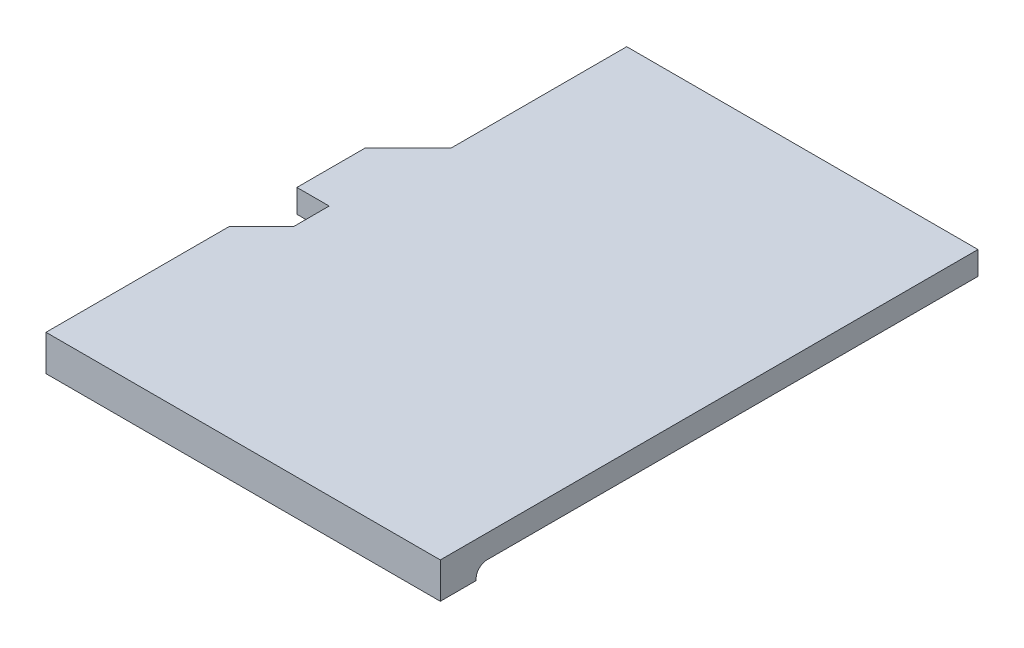
ISO-10303-21;
HEADER;
FILE_DESCRIPTION(('STEP AP214'),'2;1');
FILE_NAME('part.step','',(''),(''),'','','');
FILE_SCHEMA(('AUTOMOTIVE_DESIGN { 1 0 10303 214 1 1 1 1 }'));
ENDSEC;
DATA;
#1=APPLICATION_CONTEXT('core data for automotive mechanical design processes');
#2=APPLICATION_PROTOCOL_DEFINITION('international standard','automotive_design',2000,#1);
#3=PRODUCT_CONTEXT('',#1,'mechanical');
#4=PRODUCT('Part','Part','',(#3));
#5=PRODUCT_RELATED_PRODUCT_CATEGORY('part','',(#4));
#6=PRODUCT_DEFINITION_FORMATION('','',#4);
#7=PRODUCT_DEFINITION_CONTEXT('part definition',#1,'design');
#8=PRODUCT_DEFINITION('design','',#6,#7);
#9=PRODUCT_DEFINITION_SHAPE('','',#8);
#10=(LENGTH_UNIT() NAMED_UNIT(*) SI_UNIT(.MILLI.,.METRE.));
#11=(NAMED_UNIT(*) PLANE_ANGLE_UNIT() SI_UNIT($,.RADIAN.));
#12=(NAMED_UNIT(*) SI_UNIT($,.STERADIAN.) SOLID_ANGLE_UNIT());
#13=UNCERTAINTY_MEASURE_WITH_UNIT(LENGTH_MEASURE(1.E-05),#10,'distance_accuracy_value','');
#14=(GEOMETRIC_REPRESENTATION_CONTEXT(3) GLOBAL_UNCERTAINTY_ASSIGNED_CONTEXT((#13)) GLOBAL_UNIT_ASSIGNED_CONTEXT((#10,
#11,#12)) REPRESENTATION_CONTEXT('',''));
#15=CARTESIAN_POINT('',(0.,0.,0.));
#16=DIRECTION('',(0.,0.,1.));
#17=DIRECTION('',(1.,0.,0.));
#18=AXIS2_PLACEMENT_3D('',#15,#16,#17);
#19=CARTESIAN_POINT('',(0.,0.,36.5));
#20=DIRECTION('',(0.,-1.,0.));
#21=DIRECTION('',(0.,0.,-1.));
#22=AXIS2_PLACEMENT_3D('',#19,#20,#21);
#23=CYLINDRICAL_SURFACE('',#22,30.5);
#24=CARTESIAN_POINT('',(0.,-0.300000000000005,36.4999999999999));
#25=DIRECTION('',(0.,-1.,0.));
#26=DIRECTION('',(0.,0.,-1.));
#27=AXIS2_PLACEMENT_3D('',#24,#25,#26);
#28=CIRCLE('',#27,30.4999999999999);
#29=CARTESIAN_POINT('',(-5.5,-0.299999999999936,6.5000000000003));
#30=VERTEX_POINT('',#29);
#31=CARTESIAN_POINT('',(5.5,-0.3,6.5));
#32=VERTEX_POINT('',#31);
#33=EDGE_CURVE('E129',#30,#32,#28,.T.);
#34=ORIENTED_EDGE('',*,*,#33,.T.);
#35=DIRECTION('',(0.,-1.,0.));
#36=VECTOR('',#35,1.);
#37=CARTESIAN_POINT('',(5.5,0.,6.5));
#38=LINE('',#37,#36);
#39=CARTESIAN_POINT('',(5.5,-0.35,6.5));
#40=VERTEX_POINT('',#39);
#41=EDGE_CURVE('E115',#32,#40,#38,.T.);
#42=ORIENTED_EDGE('',*,*,#41,.T.);
#43=CARTESIAN_POINT('',(0.,-0.35,36.5));
#44=DIRECTION('',(0.,-1.,0.));
#45=DIRECTION('',(0.,0.,-1.));
#46=AXIS2_PLACEMENT_3D('',#43,#44,#45);
#47=CIRCLE('',#46,30.5);
#48=CARTESIAN_POINT('',(-5.5,-0.35,6.5));
#49=VERTEX_POINT('',#48);
#50=EDGE_CURVE('E143',#49,#40,#47,.T.);
#51=ORIENTED_EDGE('',*,*,#50,.F.);
#52=DIRECTION('',(0.,-1.,0.));
#53=VECTOR('',#52,1.);
#54=CARTESIAN_POINT('',(-5.5,0.,6.5));
#55=LINE('',#54,#53);
#56=EDGE_CURVE('E125',#49,#30,#55,.F.);
#57=ORIENTED_EDGE('',*,*,#56,.T.);
#58=EDGE_LOOP('',(#34,#42,#51,#57));
#59=FACE_BOUND('',#58,.T.);
#60=ADVANCED_FACE('F17',(#59),#23,.T.);
#61=CARTESIAN_POINT('',(0.,-0.300000000000007,36.4999999999999));
#62=DIRECTION('',(0.,1.,0.));
#63=DIRECTION('',(0.,0.,1.));
#64=AXIS2_PLACEMENT_3D('',#61,#62,#63);
#65=TOROIDAL_SURFACE('',#64,30.7999999999999,0.300000000000001);
#66=CARTESIAN_POINT('',(-5.5,0.,6.19504990929698));
#67=CARTESIAN_POINT('',(-5.5,1.33595165803878E-05,6.21241243593624));
#68=CARTESIAN_POINT('',(-5.5,-0.00145847501518897,6.22977221696308));
#69=CARTESIAN_POINT('',(-5.5,-0.00727537190632978,6.26399834794666));
#70=CARTESIAN_POINT('',(-5.5,-0.0116195368900843,6.28086485029587));
#71=CARTESIAN_POINT('',(-5.5,-0.0230876833958898,6.31363832371031));
#72=CARTESIAN_POINT('',(-5.5,-0.0302134268310064,6.32954467920917));
#73=CARTESIAN_POINT('',(-5.5,-0.0470507927273738,6.35991909095671));
#74=CARTESIAN_POINT('',(-5.5,-0.0567616224740036,6.37438758625935));
#75=CARTESIAN_POINT('',(-5.5,-0.0784276850797013,6.40135826971645));
#76=CARTESIAN_POINT('',(-5.5,-0.0903658227964889,6.41387418307365));
#77=CARTESIAN_POINT('',(-5.5,-0.116206697824979,6.43668838299136));
#78=CARTESIAN_POINT('',(-5.5,-0.130109746817412,6.4469863170733));
#79=CARTESIAN_POINT('',(-5.5,-0.159253139328433,6.4648982722723));
#80=CARTESIAN_POINT('',(-5.5,-0.17446970156573,6.47255103541422));
#81=CARTESIAN_POINT('',(-5.5,-0.205980553533483,6.48514460028019));
#82=CARTESIAN_POINT('',(-5.5,-0.22227394286474,6.4900876364088));
#83=CARTESIAN_POINT('',(-5.5,-0.248909602666306,6.49572631465982));
#84=CARTESIAN_POINT('',(-5.5,-0.259068672797319,6.4973280220839));
#85=CARTESIAN_POINT('',(-5.5,-0.279483577244796,6.49946458474798));
#86=CARTESIAN_POINT('',(-5.5,-0.289739251433868,6.50000097058269));
#87=CARTESIAN_POINT('',(-5.5,-0.299999999999871,6.50000000000061));
#88=B_SPLINE_CURVE_WITH_KNOTS('',3,(#66,#67,#68,#69,#70,#71,#72,#73,#74,#75,#76,#77,#78,#79,#80,
#81,#82,#83,#84,#85,#86,#87),.UNSPECIFIED.,.F.,.F.,(4,2,2,2,2,2,2,2,2,2,4),(0.,
0.0520216969549496,0.104027148927333,0.156065595891923,0.208088103654182,0.259726629690666,
0.311373356013652,0.362227951009608,0.413040548668621,0.443843163482689,0.474601490708804),.UNSPECIFIED.);
#89=CARTESIAN_POINT('',(-5.49999999999999,0.,6.19504990929698));
#90=VERTEX_POINT('',#89);
#91=EDGE_CURVE('E131',#90,#30,#88,.T.);
#92=ORIENTED_EDGE('',*,*,#91,.F.);
#93=CARTESIAN_POINT('',(-5.49999999999998,0.,6.19504990929698));
#94=CARTESIAN_POINT('',(-5.31863837402074,-2.79888751644408E-10,6.16213458757296));
#95=CARTESIAN_POINT('',(-5.13698177051986,-3.89986718033549E-11,6.13084467826896));
#96=CARTESIAN_POINT('',(-4.77314267713024,-2.63799173422511E-10,6.07152558301701));
#97=CARTESIAN_POINT('',(-4.59096020355433,-7.29468067132481E-10,6.04349629701301));
#98=CARTESIAN_POINT('',(-4.22612778424785,-4.11527474624292E-09,5.99070711898726));
#99=CARTESIAN_POINT('',(-4.04347785274138,-7.03533871261316E-09,5.96594712866323));
#100=CARTESIAN_POINT('',(-3.67776898719352,-1.7491268445544E-08,5.91970526678066));
#101=CARTESIAN_POINT('',(-3.49471006535823,-2.50269982460297E-08,5.898223298683));
#102=CARTESIAN_POINT('',(-3.12824231984767,-5.2489278225927E-08,5.85853971393701));
#103=CARTESIAN_POINT('',(-2.94483350641475,-7.24154710846567E-08,5.84033800271096));
#104=CARTESIAN_POINT('',(-2.57765331341793,-1.16842041325099E-07,5.80723049133915));
#105=CARTESIAN_POINT('',(-2.39388182880072,-1.41344029382589E-07,5.79232585580913));
#106=CARTESIAN_POINT('',(-2.02611648635591,-1.68785372301173E-07,5.7658417103048));
#107=CARTESIAN_POINT('',(-1.84212265072332,-1.71726725960301E-07,5.75426189219593));
#108=CARTESIAN_POINT('',(-1.47397325036579,-1.5812156273675E-07,5.73443005392329));
#109=CARTESIAN_POINT('',(-1.28981770257959,-1.41576888643872E-07,5.72617771917914));
#110=CARTESIAN_POINT('',(-0.92140570267484,-9.59041238819305E-08,5.71298847020463));
#111=CARTESIAN_POINT('',(-0.737149261997189,-6.67772466262512E-08,5.70805123638695));
#112=CARTESIAN_POINT('',(-0.368594128918169,-2.07680761947441E-08,5.70154964542096));
#113=CARTESIAN_POINT('',(-0.184295442448436,-3.88457999455793E-09,5.69998495685937));
#114=CARTESIAN_POINT('',(0.086356471172345,1.82022081381326E-09,5.70000704885872));
#115=CARTESIAN_POINT('',(0.172712230075287,7.86351842313828E-10,5.70036094948924));
#116=CARTESIAN_POINT('',(0.476263755755936,-2.79274083912713E-09,5.7028806791863));
#117=CARTESIAN_POINT('',(0.693448061531879,-5.25435587275127E-09,5.7069794575203));
#118=CARTESIAN_POINT('',(1.06816857762278,-1.97365099193209E-08,5.71801281588737));
#119=CARTESIAN_POINT('',(1.22573814440945,-2.8952196858608E-08,5.72386224765594));
#120=CARTESIAN_POINT('',(1.48630232058884,-4.72230161169837E-08,5.7355408202662));
#121=CARTESIAN_POINT('',(1.58932833528275,-5.52318131245086E-08,5.74067760392298));
#122=CARTESIAN_POINT('',(1.88171570179904,-7.7766223504317E-08,5.75673240973428));
#123=CARTESIAN_POINT('',(2.07101095849516,-9.21235436615534E-08,5.76888568094614));
#124=CARTESIAN_POINT('',(2.42722706640843,-1.10143179472391E-07,5.79507406154739));
#125=CARTESIAN_POINT('',(2.59417658530175,-1.14859561468694E-07,5.80872308812261));
#126=CARTESIAN_POINT('',(2.94460729886679,-1.15857233898678E-07,5.84026240269234));
#127=CARTESIAN_POINT('',(3.12806264619123,-1.11242583252215E-07,5.85844117104809));
#128=CARTESIAN_POINT('',(3.4946095666402,-9.80308122850376E-08,5.89809426472975));
#129=CARTESIAN_POINT('',(3.67770115300804,-8.94338397180247E-08,5.91956846776736));
#130=CARTESIAN_POINT('',(4.04346152617939,-6.89925498860165E-08,5.96580673193215));
#131=CARTESIAN_POINT('',(4.22613032868293,-5.71483552225677E-08,5.99057066883453));
#132=CARTESIAN_POINT('',(4.59098584954234,-3.40389433412459E-08,6.04337962935026));
#133=CARTESIAN_POINT('',(4.77317258614175,-2.27737039070489E-08,6.07142452692736));
#134=CARTESIAN_POINT('',(5.13700500332876,-5.88767180051038E-09,6.13078580710959));
#135=CARTESIAN_POINT('',(5.31865070476836,-2.66658712612276E-10,6.16210206191056));
#136=CARTESIAN_POINT('',(5.5,0.,6.19504990929699));
#137=B_SPLINE_CURVE_WITH_KNOTS('',3,(#93,#94,#95,#96,#97,#98,#99,#100,#101,#102,#103,#104,#105,
#106,#107,#108,#109,#110,#111,#112,#113,#114,#115,#116,#117,#118,#119,#120,#121,#122,#123,#124,
#125,#126,#127,#128,#129,#130,#131,#132,#133,#134,#135,#136),.UNSPECIFIED.,.F.,.F.,(4,2,2,2,2,2,
2,2,2,2,2,2,2,2,2,2,2,2,2,2,2,4),(0.,0.552965554943508,1.10591413701329,1.65884608905149,
2.21176175386818,2.7646614742412,3.31775618290503,3.87079961577708,4.42379075163999,
4.97672856956743,5.52961204892394,5.78868012794092,6.44029213807924,6.91330877259719,
7.22276653290295,7.79178519840863,8.29428388730775,8.84731463363147,9.40032486283035,
9.95331421554694,10.5062823324631,11.0592288542998),.UNSPECIFIED.);
#138=CARTESIAN_POINT('',(5.5,0.,6.19504990929699));
#139=VERTEX_POINT('',#138);
#140=EDGE_CURVE('E134',#90,#139,#137,.T.);
#141=ORIENTED_EDGE('',*,*,#140,.T.);
#142=CARTESIAN_POINT('',(5.5,-0.3,6.5));
#143=CARTESIAN_POINT('',(5.5,-0.283322033831807,6.50001549356666));
#144=CARTESIAN_POINT('',(5.5,-0.266650004276067,6.49858702142147));
#145=CARTESIAN_POINT('',(5.5,-0.233801135687459,6.49295846261932));
#146=CARTESIAN_POINT('',(5.5,-0.217623702847018,6.48876184803342));
#147=CARTESIAN_POINT('',(5.5,-0.186198268954705,6.4777110321617));
#148=CARTESIAN_POINT('',(5.5,-0.170950565515108,6.47085598500946));
#149=CARTESIAN_POINT('',(5.5,-0.141812064981635,6.45470279334797));
#150=CARTESIAN_POINT('',(5.5,-0.127921207933909,6.44540475685212));
#151=CARTESIAN_POINT('',(5.5,-0.101775526700828,6.42456502241336));
#152=CARTESIAN_POINT('',(5.5,-0.0895331842519982,6.41300767257655));
#153=CARTESIAN_POINT('',(5.5,-0.06712443406094,6.38802757676602));
#154=CARTESIAN_POINT('',(5.5,-0.0569584894333177,6.37460441576588));
#155=CARTESIAN_POINT('',(5.5,-0.0388245484437589,6.34605271107503));
#156=CARTESIAN_POINT('',(5.5,-0.0308934171157404,6.33090077738875));
#157=CARTESIAN_POINT('',(5.5,-0.0176486348483923,6.29949574280969));
#158=CARTESIAN_POINT('',(5.5,-0.0123340399463629,6.28324304144946));
#159=CARTESIAN_POINT('',(5.5,-0.00560463299053523,6.25494252675228));
#160=CARTESIAN_POINT('',(5.5,-0.00350419577869252,6.24305287027581));
#161=CARTESIAN_POINT('',(5.5,-0.000701922640581662,6.21912686600849));
#162=CARTESIAN_POINT('',(5.5,1.87848171905319E-06,6.20709074834657));
#163=CARTESIAN_POINT('',(5.5,0.,6.19504990929699));
#164=B_SPLINE_CURVE_WITH_KNOTS('',3,(#142,#143,#144,#145,#146,#147,#148,#149,#150,#151,#152,
#153,#154,#155,#156,#157,#158,#159,#160,#161,#162,#163),.UNSPECIFIED.,.F.,.F.,(4,2,2,2,2,2,2,2,
2,2,4),(0.,0.0499640141518205,0.0998654774886299,0.149782831636377,0.199697979128594,
0.249972031679147,0.300257285014354,0.351329048386957,0.402382373173785,0.438526062389354,
0.474618857930604),.UNSPECIFIED.);
#165=EDGE_CURVE('E22',#32,#139,#164,.T.);
#166=ORIENTED_EDGE('',*,*,#165,.F.);
#167=ORIENTED_EDGE('',*,*,#33,.F.);
#168=EDGE_LOOP('',(#92,#141,#166,#167));
#169=FACE_BOUND('',#168,.T.);
#170=ADVANCED_FACE('F19',(#169),#65,.F.);
#171=CARTESIAN_POINT('',(0.,-0.35,6.93372741582503));
#172=DIRECTION('',(0.,-1.,0.));
#173=DIRECTION('',(0.,0.,-1.));
#174=AXIS2_PLACEMENT_3D('',#171,#172,#173);
#175=PLANE('',#174);
#176=DIRECTION('',(0.,0.,1.));
#177=VECTOR('',#176,1.);
#178=CARTESIAN_POINT('',(-5.5,-0.35,2.4));
#179=LINE('',#178,#177);
#180=CARTESIAN_POINT('',(-5.5,-0.35,7.5));
#181=VERTEX_POINT('',#180);
#182=EDGE_CURVE('E253',#49,#181,#179,.T.);
#183=ORIENTED_EDGE('',*,*,#182,.F.);
#184=ORIENTED_EDGE('',*,*,#50,.T.);
#185=DIRECTION('',(0.,0.,-1.));
#186=VECTOR('',#185,1.);
#187=CARTESIAN_POINT('',(5.5,-0.35,6.93372741582503));
#188=LINE('',#187,#186);
#189=CARTESIAN_POINT('',(5.5,-0.35,7.5));
#190=VERTEX_POINT('',#189);
#191=EDGE_CURVE('E121',#40,#190,#188,.F.);
#192=ORIENTED_EDGE('',*,*,#191,.T.);
#193=DIRECTION('',(1.,0.,0.));
#194=VECTOR('',#193,1.);
#195=CARTESIAN_POINT('',(-5.5,-0.35,7.5));
#196=LINE('',#195,#194);
#197=EDGE_CURVE('E214',#181,#190,#196,.T.);
#198=ORIENTED_EDGE('',*,*,#197,.F.);
#199=EDGE_LOOP('',(#183,#184,#192,#198));
#200=FACE_BOUND('',#199,.T.);
#201=ADVANCED_FACE('F158',(#200),#175,.T.);
#202=CARTESIAN_POINT('',(0.0936244587815548,0.,0.17467868973583));
#203=DIRECTION('',(0.,1.,0.));
#204=DIRECTION('',(0.,0.,1.));
#205=AXIS2_PLACEMENT_3D('',#202,#203,#204);
#206=PLANE('',#205);
#207=DIRECTION('',(-0.707106781186547,0.,0.707106781186548));
#208=VECTOR('',#207,1.);
#209=CARTESIAN_POINT('',(-4.6,0.,1.5));
#210=LINE('',#209,#208);
#211=CARTESIAN_POINT('',(-4.6,0.,1.5));
#212=VERTEX_POINT('',#211);
#213=CARTESIAN_POINT('',(-5.5,0.,2.4));
#214=VERTEX_POINT('',#213);
#215=EDGE_CURVE('E278',#212,#214,#210,.T.);
#216=ORIENTED_EDGE('',*,*,#215,.F.);
#217=DIRECTION('',(0.,0.,1.));
#218=VECTOR('',#217,1.);
#219=CARTESIAN_POINT('',(-4.6,0.,0.17467868973583));
#220=LINE('',#219,#218);
#221=CARTESIAN_POINT('',(-4.6,0.,0.5));
#222=VERTEX_POINT('',#221);
#223=EDGE_CURVE('E282',#222,#212,#220,.T.);
#224=ORIENTED_EDGE('',*,*,#223,.F.);
#225=DIRECTION('',(1.,0.,0.));
#226=VECTOR('',#225,1.);
#227=CARTESIAN_POINT('',(0.0936244587815548,0.,0.5));
#228=LINE('',#227,#226);
#229=CARTESIAN_POINT('',(-5.5,0.,0.5));
#230=VERTEX_POINT('',#229);
#231=EDGE_CURVE('E292',#230,#222,#228,.T.);
#232=ORIENTED_EDGE('',*,*,#231,.F.);
#233=DIRECTION('',(0.,0.,1.));
#234=VECTOR('',#233,1.);
#235=CARTESIAN_POINT('',(-5.5,0.,-1.4));
#236=LINE('',#235,#234);
#237=CARTESIAN_POINT('',(-5.5,0.,-1.4));
#238=VERTEX_POINT('',#237);
#239=EDGE_CURVE('E236',#238,#230,#236,.T.);
#240=ORIENTED_EDGE('',*,*,#239,.F.);
#241=DIRECTION('',(-0.707106781186548,0.,0.707106781186547));
#242=VECTOR('',#241,1.);
#243=CARTESIAN_POINT('',(-4.3,0.,-2.6));
#244=LINE('',#243,#242);
#245=CARTESIAN_POINT('',(-4.3,0.,-2.6));
#246=VERTEX_POINT('',#245);
#247=EDGE_CURVE('E237',#246,#238,#244,.T.);
#248=ORIENTED_EDGE('',*,*,#247,.F.);
#249=DIRECTION('',(0.,0.,1.));
#250=VECTOR('',#249,1.);
#251=CARTESIAN_POINT('',(-4.3,0.,-7.5));
#252=LINE('',#251,#250);
#253=CARTESIAN_POINT('',(-4.3,0.,-7.5));
#254=VERTEX_POINT('',#253);
#255=EDGE_CURVE('E242',#254,#246,#252,.T.);
#256=ORIENTED_EDGE('',*,*,#255,.F.);
#257=DIRECTION('',(-1.,0.,0.));
#258=VECTOR('',#257,1.);
#259=CARTESIAN_POINT('',(5.5,0.,-7.5));
#260=LINE('',#259,#258);
#261=CARTESIAN_POINT('',(5.5,0.,-7.5));
#262=VERTEX_POINT('',#261);
#263=EDGE_CURVE('E247',#262,#254,#260,.T.);
#264=ORIENTED_EDGE('',*,*,#263,.F.);
#265=DIRECTION('',(0.,0.,-1.));
#266=VECTOR('',#265,1.);
#267=CARTESIAN_POINT('',(5.5,0.,7.5));
#268=LINE('',#267,#266);
#269=EDGE_CURVE('E216',#139,#262,#268,.T.);
#270=ORIENTED_EDGE('',*,*,#269,.F.);
#271=ORIENTED_EDGE('',*,*,#140,.F.);
#272=DIRECTION('',(0.,0.,1.));
#273=VECTOR('',#272,1.);
#274=CARTESIAN_POINT('',(-5.5,0.,2.4));
#275=LINE('',#274,#273);
#276=EDGE_CURVE('E251',#214,#90,#275,.T.);
#277=ORIENTED_EDGE('',*,*,#276,.F.);
#278=EDGE_LOOP('',(#216,#224,#232,#240,#248,#256,#264,#270,#271,#277));
#279=FACE_BOUND('',#278,.T.);
#280=ADVANCED_FACE('F154',(#279),#206,.F.);
#281=CARTESIAN_POINT('',(-4.6,0.,1.5));
#282=DIRECTION('',(-0.707106781186548,0.,-0.707106781186547));
#283=DIRECTION('',(-0.707106781186547,0.,0.707106781186548));
#284=AXIS2_PLACEMENT_3D('',#281,#282,#283);
#285=PLANE('',#284);
#286=ORIENTED_EDGE('',*,*,#215,.T.);
#287=DIRECTION('',(0.,1.,0.));
#288=VECTOR('',#287,1.);
#289=CARTESIAN_POINT('',(-5.5,0.,2.4));
#290=LINE('',#289,#288);
#291=CARTESIAN_POINT('',(-5.5,0.65,2.4));
#292=VERTEX_POINT('',#291);
#293=EDGE_CURVE('E254',#292,#214,#290,.F.);
#294=ORIENTED_EDGE('',*,*,#293,.F.);
#295=DIRECTION('',(-0.707106781186548,0.,0.707106781186548));
#296=VECTOR('',#295,1.);
#297=CARTESIAN_POINT('',(-4.6,0.65,1.5));
#298=LINE('',#297,#296);
#299=CARTESIAN_POINT('',(-4.6,0.65,1.5));
#300=VERTEX_POINT('',#299);
#301=EDGE_CURVE('E229',#300,#292,#298,.T.);
#302=ORIENTED_EDGE('',*,*,#301,.F.);
#303=DIRECTION('',(0.,1.,0.));
#304=VECTOR('',#303,1.);
#305=CARTESIAN_POINT('',(-4.6,0.,1.5));
#306=LINE('',#305,#304);
#307=EDGE_CURVE('E288',#212,#300,#306,.T.);
#308=ORIENTED_EDGE('',*,*,#307,.F.);
#309=EDGE_LOOP('',(#286,#294,#302,#308));
#310=FACE_BOUND('',#309,.T.);
#311=ADVANCED_FACE('F151',(#310),#285,.T.);
#312=CARTESIAN_POINT('',(-5.5,0.,2.4));
#313=DIRECTION('',(-1.,0.,0.));
#314=DIRECTION('',(0.,0.,1.));
#315=AXIS2_PLACEMENT_3D('',#312,#313,#314);
#316=PLANE('',#315);
#317=ORIENTED_EDGE('',*,*,#182,.T.);
#318=DIRECTION('',(0.,1.,0.));
#319=VECTOR('',#318,1.);
#320=CARTESIAN_POINT('',(-5.5,0.,7.5));
#321=LINE('',#320,#319);
#322=CARTESIAN_POINT('',(-5.5,0.65,7.5));
#323=VERTEX_POINT('',#322);
#324=EDGE_CURVE('E267',#323,#181,#321,.F.);
#325=ORIENTED_EDGE('',*,*,#324,.F.);
#326=DIRECTION('',(0.,0.,1.));
#327=VECTOR('',#326,1.);
#328=CARTESIAN_POINT('',(-5.5,0.65,0.17467868973583));
#329=LINE('',#328,#327);
#330=EDGE_CURVE('E227',#292,#323,#329,.T.);
#331=ORIENTED_EDGE('',*,*,#330,.F.);
#332=ORIENTED_EDGE('',*,*,#293,.T.);
#333=ORIENTED_EDGE('',*,*,#276,.T.);
#334=ORIENTED_EDGE('',*,*,#91,.T.);
#335=ORIENTED_EDGE('',*,*,#56,.F.);
#336=EDGE_LOOP('',(#317,#325,#331,#332,#333,#334,#335));
#337=FACE_BOUND('',#336,.T.);
#338=ADVANCED_FACE('F145',(#337),#316,.T.);
#339=CARTESIAN_POINT('',(-5.5,0.,7.5));
#340=DIRECTION('',(0.,0.,1.));
#341=DIRECTION('',(1.,0.,0.));
#342=AXIS2_PLACEMENT_3D('',#339,#340,#341);
#343=PLANE('',#342);
#344=DIRECTION('',(0.,1.,0.));
#345=VECTOR('',#344,1.);
#346=CARTESIAN_POINT('',(5.5,0.,7.5));
#347=LINE('',#346,#345);
#348=CARTESIAN_POINT('',(5.5,0.65,7.5));
#349=VERTEX_POINT('',#348);
#350=EDGE_CURVE('E207',#349,#190,#347,.F.);
#351=ORIENTED_EDGE('',*,*,#350,.F.);
#352=DIRECTION('',(1.,0.,0.));
#353=VECTOR('',#352,1.);
#354=CARTESIAN_POINT('',(0.0936244587815549,0.65,7.5));
#355=LINE('',#354,#353);
#356=EDGE_CURVE('E211',#323,#349,#355,.T.);
#357=ORIENTED_EDGE('',*,*,#356,.F.);
#358=ORIENTED_EDGE('',*,*,#324,.T.);
#359=ORIENTED_EDGE('',*,*,#197,.T.);
#360=EDGE_LOOP('',(#351,#357,#358,#359));
#361=FACE_BOUND('',#360,.T.);
#362=ADVANCED_FACE('F150',(#361),#343,.T.);
#363=CARTESIAN_POINT('',(5.5,0.,7.5));
#364=DIRECTION('',(1.,0.,0.));
#365=DIRECTION('',(0.,0.,-1.));
#366=AXIS2_PLACEMENT_3D('',#363,#364,#365);
#367=PLANE('',#366);
#368=ORIENTED_EDGE('',*,*,#350,.T.);
#369=ORIENTED_EDGE('',*,*,#191,.F.);
#370=ORIENTED_EDGE('',*,*,#41,.F.);
#371=ORIENTED_EDGE('',*,*,#165,.T.);
#372=ORIENTED_EDGE('',*,*,#269,.T.);
#373=DIRECTION('',(0.,1.,0.));
#374=VECTOR('',#373,1.);
#375=CARTESIAN_POINT('',(5.5,0.,-7.5));
#376=LINE('',#375,#374);
#377=CARTESIAN_POINT('',(5.5,0.65,-7.5));
#378=VERTEX_POINT('',#377);
#379=EDGE_CURVE('E215',#378,#262,#376,.F.);
#380=ORIENTED_EDGE('',*,*,#379,.F.);
#381=DIRECTION('',(0.,0.,1.));
#382=VECTOR('',#381,1.);
#383=CARTESIAN_POINT('',(5.5,0.65,0.17467868973583));
#384=LINE('',#383,#382);
#385=EDGE_CURVE('E219',#349,#378,#384,.F.);
#386=ORIENTED_EDGE('',*,*,#385,.F.);
#387=EDGE_LOOP('',(#368,#369,#370,#371,#372,#380,#386));
#388=FACE_BOUND('',#387,.T.);
#389=ADVANCED_FACE('F118',(#388),#367,.T.);
#390=CARTESIAN_POINT('',(5.5,0.,-7.5));
#391=DIRECTION('',(0.,0.,-1.));
#392=DIRECTION('',(-1.,0.,0.));
#393=AXIS2_PLACEMENT_3D('',#390,#391,#392);
#394=PLANE('',#393);
#395=ORIENTED_EDGE('',*,*,#263,.T.);
#396=DIRECTION('',(0.,1.,0.));
#397=VECTOR('',#396,1.);
#398=CARTESIAN_POINT('',(-4.3,0.,-7.5));
#399=LINE('',#398,#397);
#400=CARTESIAN_POINT('',(-4.3,0.65,-7.5));
#401=VERTEX_POINT('',#400);
#402=EDGE_CURVE('E244',#401,#254,#399,.F.);
#403=ORIENTED_EDGE('',*,*,#402,.F.);
#404=DIRECTION('',(1.,0.,0.));
#405=VECTOR('',#404,1.);
#406=CARTESIAN_POINT('',(0.0936244587815549,0.65,-7.5));
#407=LINE('',#406,#405);
#408=EDGE_CURVE('E223',#378,#401,#407,.F.);
#409=ORIENTED_EDGE('',*,*,#408,.F.);
#410=ORIENTED_EDGE('',*,*,#379,.T.);
#411=EDGE_LOOP('',(#395,#403,#409,#410));
#412=FACE_BOUND('',#411,.T.);
#413=ADVANCED_FACE('F193',(#412),#394,.T.);
#414=CARTESIAN_POINT('',(-4.3,0.,-7.5));
#415=DIRECTION('',(-1.,0.,0.));
#416=DIRECTION('',(0.,0.,1.));
#417=AXIS2_PLACEMENT_3D('',#414,#415,#416);
#418=PLANE('',#417);
#419=ORIENTED_EDGE('',*,*,#255,.T.);
#420=DIRECTION('',(0.,1.,0.));
#421=VECTOR('',#420,1.);
#422=CARTESIAN_POINT('',(-4.3,0.,-2.6));
#423=LINE('',#422,#421);
#424=CARTESIAN_POINT('',(-4.3,0.65,-2.6));
#425=VERTEX_POINT('',#424);
#426=EDGE_CURVE('E239',#425,#246,#423,.F.);
#427=ORIENTED_EDGE('',*,*,#426,.F.);
#428=DIRECTION('',(0.,0.,1.));
#429=VECTOR('',#428,1.);
#430=CARTESIAN_POINT('',(-4.3,0.65,0.17467868973583));
#431=LINE('',#430,#429);
#432=EDGE_CURVE('E332',#401,#425,#431,.T.);
#433=ORIENTED_EDGE('',*,*,#432,.F.);
#434=ORIENTED_EDGE('',*,*,#402,.T.);
#435=EDGE_LOOP('',(#419,#427,#433,#434));
#436=FACE_BOUND('',#435,.T.);
#437=ADVANCED_FACE('F189',(#436),#418,.T.);
#438=CARTESIAN_POINT('',(-4.3,0.,-2.6));
#439=DIRECTION('',(-0.707106781186547,0.,-0.707106781186548));
#440=DIRECTION('',(-0.707106781186548,0.,0.707106781186547));
#441=AXIS2_PLACEMENT_3D('',#438,#439,#440);
#442=PLANE('',#441);
#443=ORIENTED_EDGE('',*,*,#247,.T.);
#444=DIRECTION('',(0.,1.,0.));
#445=VECTOR('',#444,1.);
#446=CARTESIAN_POINT('',(-5.5,0.,-1.4));
#447=LINE('',#446,#445);
#448=CARTESIAN_POINT('',(-5.5,0.65,-1.4));
#449=VERTEX_POINT('',#448);
#450=EDGE_CURVE('E233',#449,#238,#447,.F.);
#451=ORIENTED_EDGE('',*,*,#450,.F.);
#452=DIRECTION('',(-0.707106781186547,0.,0.707106781186547));
#453=VECTOR('',#452,1.);
#454=CARTESIAN_POINT('',(-4.3,0.65,-2.6));
#455=LINE('',#454,#453);
#456=EDGE_CURVE('E333',#425,#449,#455,.T.);
#457=ORIENTED_EDGE('',*,*,#456,.F.);
#458=ORIENTED_EDGE('',*,*,#426,.T.);
#459=EDGE_LOOP('',(#443,#451,#457,#458));
#460=FACE_BOUND('',#459,.T.);
#461=ADVANCED_FACE('F185',(#460),#442,.T.);
#462=CARTESIAN_POINT('',(-5.5,0.,-1.4));
#463=DIRECTION('',(-1.,0.,0.));
#464=DIRECTION('',(0.,0.,1.));
#465=AXIS2_PLACEMENT_3D('',#462,#463,#464);
#466=PLANE('',#465);
#467=ORIENTED_EDGE('',*,*,#239,.T.);
#468=DIRECTION('',(0.,1.,0.));
#469=VECTOR('',#468,1.);
#470=CARTESIAN_POINT('',(-5.5,0.,0.5));
#471=LINE('',#470,#469);
#472=CARTESIAN_POINT('',(-5.5,0.65,0.5));
#473=VERTEX_POINT('',#472);
#474=EDGE_CURVE('E300',#473,#230,#471,.F.);
#475=ORIENTED_EDGE('',*,*,#474,.F.);
#476=DIRECTION('',(0.,0.,1.));
#477=VECTOR('',#476,1.);
#478=CARTESIAN_POINT('',(-5.5,0.65,0.17467868973583));
#479=LINE('',#478,#477);
#480=EDGE_CURVE('E338',#449,#473,#479,.T.);
#481=ORIENTED_EDGE('',*,*,#480,.F.);
#482=ORIENTED_EDGE('',*,*,#450,.T.);
#483=EDGE_LOOP('',(#467,#475,#481,#482));
#484=FACE_BOUND('',#483,.T.);
#485=ADVANCED_FACE('F182',(#484),#466,.T.);
#486=CARTESIAN_POINT('',(-5.5,0.,0.5));
#487=DIRECTION('',(0.,0.,1.));
#488=DIRECTION('',(1.,0.,0.));
#489=AXIS2_PLACEMENT_3D('',#486,#487,#488);
#490=PLANE('',#489);
#491=ORIENTED_EDGE('',*,*,#231,.T.);
#492=DIRECTION('',(0.,1.,0.));
#493=VECTOR('',#492,1.);
#494=CARTESIAN_POINT('',(-4.6,0.,0.5));
#495=LINE('',#494,#493);
#496=CARTESIAN_POINT('',(-4.6,0.65,0.5));
#497=VERTEX_POINT('',#496);
#498=EDGE_CURVE('E41',#497,#222,#495,.F.);
#499=ORIENTED_EDGE('',*,*,#498,.F.);
#500=DIRECTION('',(1.,0.,0.));
#501=VECTOR('',#500,1.);
#502=CARTESIAN_POINT('',(0.0936244587815549,0.65,0.5));
#503=LINE('',#502,#501);
#504=EDGE_CURVE('E32',#473,#497,#503,.T.);
#505=ORIENTED_EDGE('',*,*,#504,.F.);
#506=ORIENTED_EDGE('',*,*,#474,.T.);
#507=EDGE_LOOP('',(#491,#499,#505,#506));
#508=FACE_BOUND('',#507,.T.);
#509=ADVANCED_FACE('F175',(#508),#490,.T.);
#510=CARTESIAN_POINT('',(-4.6,0.,0.5));
#511=DIRECTION('',(-1.,0.,0.));
#512=DIRECTION('',(0.,0.,1.));
#513=AXIS2_PLACEMENT_3D('',#510,#511,#512);
#514=PLANE('',#513);
#515=ORIENTED_EDGE('',*,*,#223,.T.);
#516=ORIENTED_EDGE('',*,*,#307,.T.);
#517=DIRECTION('',(0.,0.,1.));
#518=VECTOR('',#517,1.);
#519=CARTESIAN_POINT('',(-4.6,0.65,0.17467868973583));
#520=LINE('',#519,#518);
#521=EDGE_CURVE('E11',#497,#300,#520,.T.);
#522=ORIENTED_EDGE('',*,*,#521,.F.);
#523=ORIENTED_EDGE('',*,*,#498,.T.);
#524=EDGE_LOOP('',(#515,#516,#522,#523));
#525=FACE_BOUND('',#524,.T.);
#526=ADVANCED_FACE('F169',(#525),#514,.T.);
#527=CARTESIAN_POINT('',(0.0936244587815549,0.65,0.17467868973583));
#528=DIRECTION('',(0.,1.,0.));
#529=DIRECTION('',(0.,0.,1.));
#530=AXIS2_PLACEMENT_3D('',#527,#528,#529);
#531=PLANE('',#530);
#532=ORIENTED_EDGE('',*,*,#504,.T.);
#533=ORIENTED_EDGE('',*,*,#521,.T.);
#534=ORIENTED_EDGE('',*,*,#301,.T.);
#535=ORIENTED_EDGE('',*,*,#330,.T.);
#536=ORIENTED_EDGE('',*,*,#356,.T.);
#537=ORIENTED_EDGE('',*,*,#385,.T.);
#538=ORIENTED_EDGE('',*,*,#408,.T.);
#539=ORIENTED_EDGE('',*,*,#432,.T.);
#540=ORIENTED_EDGE('',*,*,#456,.T.);
#541=ORIENTED_EDGE('',*,*,#480,.T.);
#542=EDGE_LOOP('',(#532,#533,#534,#535,#536,#537,#538,#539,#540,#541));
#543=FACE_BOUND('',#542,.T.);
#544=ADVANCED_FACE('F167',(#543),#531,.T.);
#545=CLOSED_SHELL('',(#60,#170,#201,#280,#311,#338,#362,#389,#413,#437,#461,#485,#509,#526,#544));
#546=MANIFOLD_SOLID_BREP('B1',#545);
#547=ADVANCED_BREP_SHAPE_REPRESENTATION('',(#18,#546),#14);
#548=SHAPE_DEFINITION_REPRESENTATION(#9,#547);
ENDSEC;
END-ISO-10303-21;
